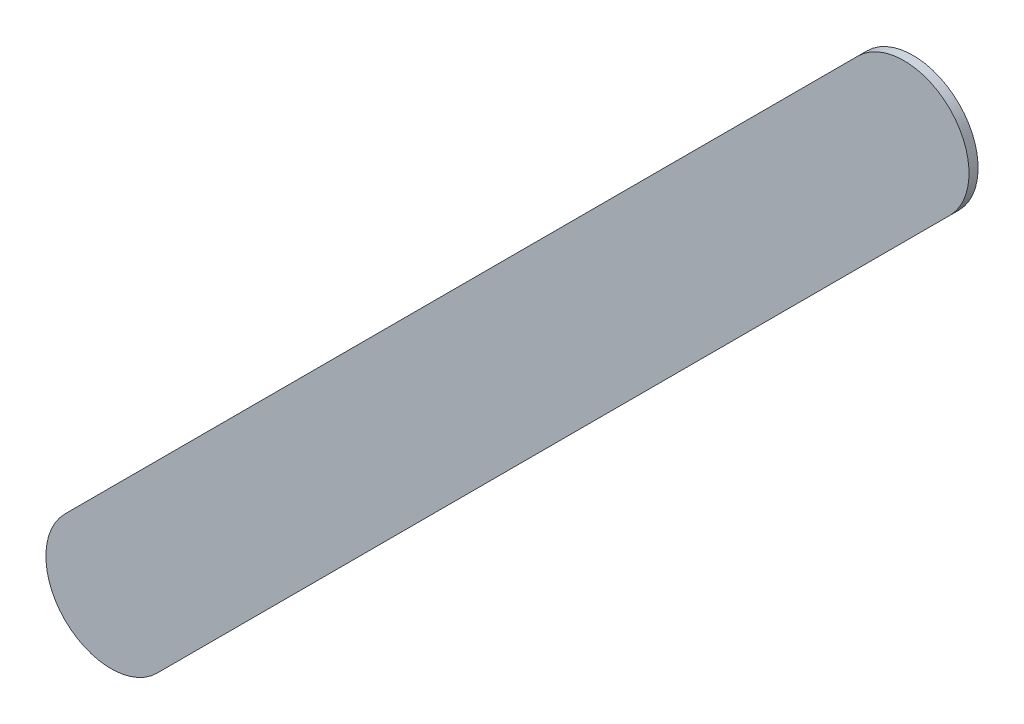
ISO-10303-21;
HEADER;
FILE_DESCRIPTION(('STEP AP214'),'2;1');
FILE_NAME('part.step','',(''),(''),'','','');
FILE_SCHEMA(('AUTOMOTIVE_DESIGN { 1 0 10303 214 1 1 1 1 }'));
ENDSEC;
DATA;
#1=APPLICATION_CONTEXT('core data for automotive mechanical design processes');
#2=APPLICATION_PROTOCOL_DEFINITION('international standard','automotive_design',2000,#1);
#3=PRODUCT_CONTEXT('',#1,'mechanical');
#4=PRODUCT('Part','Part','',(#3));
#5=PRODUCT_RELATED_PRODUCT_CATEGORY('part','',(#4));
#6=PRODUCT_DEFINITION_FORMATION('','',#4);
#7=PRODUCT_DEFINITION_CONTEXT('part definition',#1,'design');
#8=PRODUCT_DEFINITION('design','',#6,#7);
#9=PRODUCT_DEFINITION_SHAPE('','',#8);
#10=(LENGTH_UNIT() NAMED_UNIT(*) SI_UNIT(.MILLI.,.METRE.));
#11=(NAMED_UNIT(*) PLANE_ANGLE_UNIT() SI_UNIT($,.RADIAN.));
#12=(NAMED_UNIT(*) SI_UNIT($,.STERADIAN.) SOLID_ANGLE_UNIT());
#13=UNCERTAINTY_MEASURE_WITH_UNIT(LENGTH_MEASURE(1.E-05),#10,'distance_accuracy_value','');
#14=(GEOMETRIC_REPRESENTATION_CONTEXT(3) GLOBAL_UNCERTAINTY_ASSIGNED_CONTEXT((#13)) GLOBAL_UNIT_ASSIGNED_CONTEXT((#10,
#11,#12)) REPRESENTATION_CONTEXT('',''));
#15=CARTESIAN_POINT('',(0.,0.,0.));
#16=DIRECTION('',(0.,0.,1.));
#17=DIRECTION('',(1.,0.,0.));
#18=AXIS2_PLACEMENT_3D('',#15,#16,#17);
#19=CARTESIAN_POINT('',(127.331223,-75.007223,0.));
#20=DIRECTION('',(0.,0.,1.));
#21=DIRECTION('',(1.,0.,0.));
#22=AXIS2_PLACEMENT_3D('',#19,#20,#21);
#23=PLANE('',#22);
#24=DIRECTION('',(-0.707106781186548,-0.707106781186548,0.));
#25=VECTOR('',#24,1.);
#26=CARTESIAN_POINT('',(127.331223,-75.007223,0.));
#27=LINE('',#26,#25);
#28=CARTESIAN_POINT('',(127.331223,-75.007223,0.));
#29=VERTEX_POINT('',#28);
#30=CARTESIAN_POINT('',(124.283223,-78.055223,0.));
#31=VERTEX_POINT('',#30);
#32=EDGE_CURVE('E83',#29,#31,#27,.T.);
#33=ORIENTED_EDGE('',*,*,#32,.T.);
#34=CARTESIAN_POINT('',(124.4599995,-78.2319995,0.));
#35=DIRECTION('',(0.,0.,1.));
#36=DIRECTION('',(-0.707106781186548,0.707106781186548,0.));
#37=AXIS2_PLACEMENT_3D('',#34,#35,#36);
#38=CIRCLE('',#37,0.249999723809);
#39=CARTESIAN_POINT('',(124.636776,-78.408776,0.));
#40=VERTEX_POINT('',#39);
#41=EDGE_CURVE('E106',#31,#40,#38,.T.);
#42=ORIENTED_EDGE('',*,*,#41,.T.);
#43=DIRECTION('',(0.707106781186548,0.707106781186548,0.));
#44=VECTOR('',#43,1.);
#45=CARTESIAN_POINT('',(124.636776,-78.408776,0.));
#46=LINE('',#45,#44);
#47=CARTESIAN_POINT('',(127.684776,-75.360776,0.));
#48=VERTEX_POINT('',#47);
#49=EDGE_CURVE('E75',#40,#48,#46,.T.);
#50=ORIENTED_EDGE('',*,*,#49,.T.);
#51=CARTESIAN_POINT('',(127.5079995,-75.1839995,0.));
#52=DIRECTION('',(0.,0.,1.));
#53=DIRECTION('',(0.707106781186548,-0.707106781186548,0.));
#54=AXIS2_PLACEMENT_3D('',#51,#52,#53);
#55=CIRCLE('',#54,0.249999723809);
#56=EDGE_CURVE('E11',#48,#29,#55,.T.);
#57=ORIENTED_EDGE('',*,*,#56,.T.);
#58=EDGE_LOOP('',(#33,#42,#50,#57));
#59=FACE_BOUND('',#58,.T.);
#60=ADVANCED_FACE('F17',(#59),#23,.T.);
#61=CARTESIAN_POINT('',(127.331223,-75.007223,-0.035));
#62=DIRECTION('',(0.,0.,1.));
#63=DIRECTION('',(1.,0.,0.));
#64=AXIS2_PLACEMENT_3D('',#61,#62,#63);
#65=PLANE('',#64);
#66=CARTESIAN_POINT('',(127.5079995,-75.1839995,-0.035));
#67=DIRECTION('',(0.,0.,1.));
#68=DIRECTION('',(0.707106781186548,-0.707106781186548,0.));
#69=AXIS2_PLACEMENT_3D('',#66,#67,#68);
#70=CIRCLE('',#69,0.249999723809);
#71=CARTESIAN_POINT('',(127.684776,-75.360776,-0.035));
#72=VERTEX_POINT('',#71);
#73=CARTESIAN_POINT('',(127.331223,-75.007223,-0.035));
#74=VERTEX_POINT('',#73);
#75=EDGE_CURVE('E26',#72,#74,#70,.T.);
#76=ORIENTED_EDGE('',*,*,#75,.F.);
#77=DIRECTION('',(0.707106781186548,0.707106781186548,0.));
#78=VECTOR('',#77,1.);
#79=CARTESIAN_POINT('',(124.636776,-78.408776,-0.035));
#80=LINE('',#79,#78);
#81=CARTESIAN_POINT('',(124.636776,-78.408776,-0.035));
#82=VERTEX_POINT('',#81);
#83=EDGE_CURVE('E109',#82,#72,#80,.T.);
#84=ORIENTED_EDGE('',*,*,#83,.F.);
#85=CARTESIAN_POINT('',(124.4599995,-78.2319995,-0.035));
#86=DIRECTION('',(0.,0.,1.));
#87=DIRECTION('',(-0.707106781186548,0.707106781186548,0.));
#88=AXIS2_PLACEMENT_3D('',#85,#86,#87);
#89=CIRCLE('',#88,0.249999723809);
#90=CARTESIAN_POINT('',(124.283223,-78.055223,-0.035));
#91=VERTEX_POINT('',#90);
#92=EDGE_CURVE('E85',#91,#82,#89,.T.);
#93=ORIENTED_EDGE('',*,*,#92,.F.);
#94=DIRECTION('',(-0.707106781186548,-0.707106781186548,0.));
#95=VECTOR('',#94,1.);
#96=CARTESIAN_POINT('',(127.331223,-75.007223,-0.035));
#97=LINE('',#96,#95);
#98=EDGE_CURVE('E81',#74,#91,#97,.T.);
#99=ORIENTED_EDGE('',*,*,#98,.F.);
#100=EDGE_LOOP('',(#76,#84,#93,#99));
#101=FACE_BOUND('',#100,.T.);
#102=ADVANCED_FACE('F19',(#101),#65,.F.);
#103=CARTESIAN_POINT('',(127.5079995,-75.1839995,-0.035));
#104=DIRECTION('',(0.,0.,-1.));
#105=DIRECTION('',(0.707106781186548,-0.707106781186548,0.));
#106=AXIS2_PLACEMENT_3D('',#103,#104,#105);
#107=CYLINDRICAL_SURFACE('',#106,0.249999723809);
#108=ORIENTED_EDGE('',*,*,#75,.T.);
#109=DIRECTION('',(0.,0.,1.));
#110=VECTOR('',#109,1.);
#111=CARTESIAN_POINT('',(127.331223,-75.007223,-0.035));
#112=LINE('',#111,#110);
#113=EDGE_CURVE('E69',#74,#29,#112,.T.);
#114=ORIENTED_EDGE('',*,*,#113,.T.);
#115=ORIENTED_EDGE('',*,*,#56,.F.);
#116=DIRECTION('',(0.,0.,1.));
#117=VECTOR('',#116,1.);
#118=CARTESIAN_POINT('',(127.684776,-75.360776,-0.035));
#119=LINE('',#118,#117);
#120=EDGE_CURVE('E72',#72,#48,#119,.T.);
#121=ORIENTED_EDGE('',*,*,#120,.F.);
#122=EDGE_LOOP('',(#108,#114,#115,#121));
#123=FACE_BOUND('',#122,.T.);
#124=ADVANCED_FACE('F68',(#123),#107,.T.);
#125=CARTESIAN_POINT('',(124.636776,-78.408776,-0.035));
#126=DIRECTION('',(-0.707106781186548,0.707106781186548,0.));
#127=DIRECTION('',(0.,0.,1.));
#128=AXIS2_PLACEMENT_3D('',#125,#126,#127);
#129=PLANE('',#128);
#130=ORIENTED_EDGE('',*,*,#83,.T.);
#131=ORIENTED_EDGE('',*,*,#120,.T.);
#132=ORIENTED_EDGE('',*,*,#49,.F.);
#133=DIRECTION('',(0.,0.,1.));
#134=VECTOR('',#133,1.);
#135=CARTESIAN_POINT('',(124.636776,-78.408776,-0.035));
#136=LINE('',#135,#134);
#137=EDGE_CURVE('E102',#82,#40,#136,.T.);
#138=ORIENTED_EDGE('',*,*,#137,.F.);
#139=EDGE_LOOP('',(#130,#131,#132,#138));
#140=FACE_BOUND('',#139,.T.);
#141=ADVANCED_FACE('F118',(#140),#129,.F.);
#142=CARTESIAN_POINT('',(124.4599995,-78.2319995,-0.035));
#143=DIRECTION('',(0.,0.,-1.));
#144=DIRECTION('',(-0.707106781186548,0.707106781186548,0.));
#145=AXIS2_PLACEMENT_3D('',#142,#143,#144);
#146=CYLINDRICAL_SURFACE('',#145,0.249999723809);
#147=ORIENTED_EDGE('',*,*,#92,.T.);
#148=ORIENTED_EDGE('',*,*,#137,.T.);
#149=ORIENTED_EDGE('',*,*,#41,.F.);
#150=DIRECTION('',(0.,0.,1.));
#151=VECTOR('',#150,1.);
#152=CARTESIAN_POINT('',(124.283223,-78.055223,-0.035));
#153=LINE('',#152,#151);
#154=EDGE_CURVE('E90',#91,#31,#153,.T.);
#155=ORIENTED_EDGE('',*,*,#154,.F.);
#156=EDGE_LOOP('',(#147,#148,#149,#155));
#157=FACE_BOUND('',#156,.T.);
#158=ADVANCED_FACE('F121',(#157),#146,.T.);
#159=CARTESIAN_POINT('',(127.331223,-75.007223,-0.035));
#160=DIRECTION('',(0.707106781186548,-0.707106781186548,0.));
#161=DIRECTION('',(0.,0.,-1.));
#162=AXIS2_PLACEMENT_3D('',#159,#160,#161);
#163=PLANE('',#162);
#164=ORIENTED_EDGE('',*,*,#98,.T.);
#165=ORIENTED_EDGE('',*,*,#154,.T.);
#166=ORIENTED_EDGE('',*,*,#32,.F.);
#167=ORIENTED_EDGE('',*,*,#113,.F.);
#168=EDGE_LOOP('',(#164,#165,#166,#167));
#169=FACE_BOUND('',#168,.T.);
#170=ADVANCED_FACE('F79',(#169),#163,.F.);
#171=CLOSED_SHELL('',(#60,#102,#124,#141,#158,#170));
#172=MANIFOLD_SOLID_BREP('B1',#171);
#173=ADVANCED_BREP_SHAPE_REPRESENTATION('',(#18,#172),#14);
#174=SHAPE_DEFINITION_REPRESENTATION(#9,#173);
ENDSEC;
END-ISO-10303-21;
